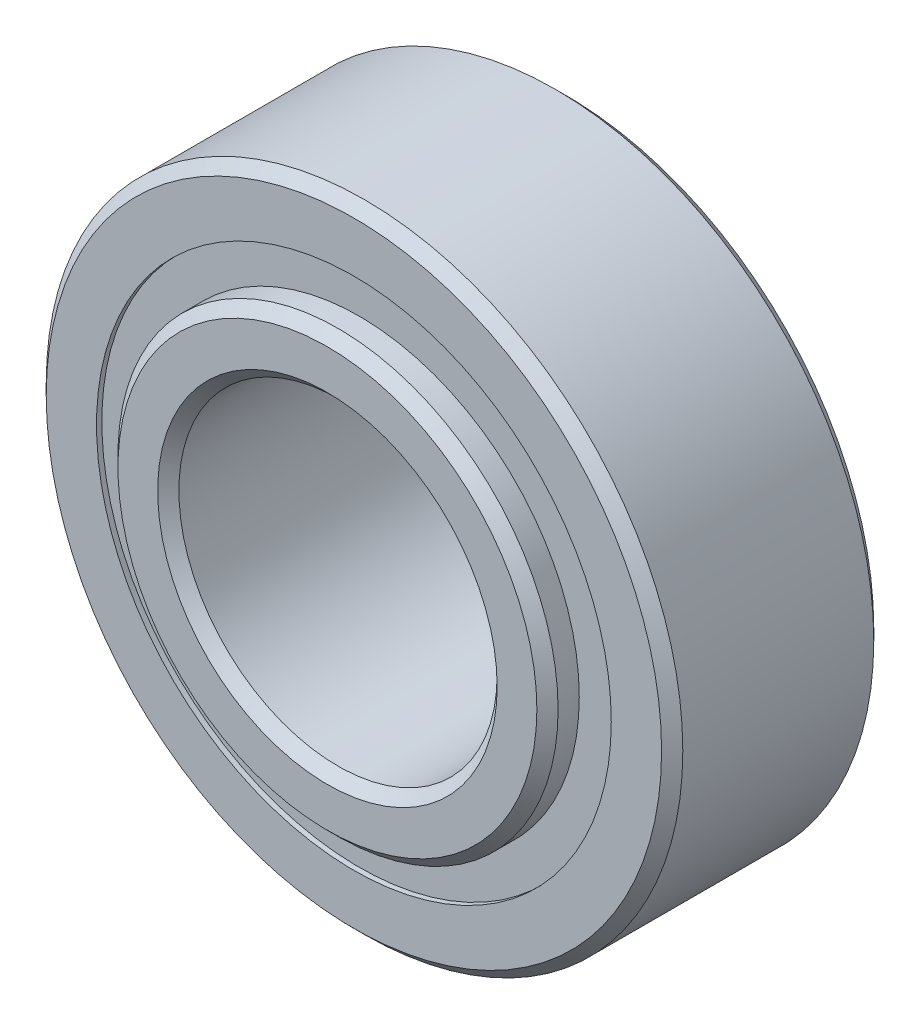
ISO-10303-21;
HEADER;
FILE_DESCRIPTION(('STEP AP214'),'2;1');
FILE_NAME('part.step','',(''),(''),'','','');
FILE_SCHEMA(('AUTOMOTIVE_DESIGN { 1 0 10303 214 1 1 1 1 }'));
ENDSEC;
DATA;
#1=APPLICATION_CONTEXT('core data for automotive mechanical design processes');
#2=APPLICATION_PROTOCOL_DEFINITION('international standard','automotive_design',2000,#1);
#3=PRODUCT_CONTEXT('',#1,'mechanical');
#4=PRODUCT('Part','Part','',(#3));
#5=PRODUCT_RELATED_PRODUCT_CATEGORY('part','',(#4));
#6=PRODUCT_DEFINITION_FORMATION('','',#4);
#7=PRODUCT_DEFINITION_CONTEXT('part definition',#1,'design');
#8=PRODUCT_DEFINITION('design','',#6,#7);
#9=PRODUCT_DEFINITION_SHAPE('','',#8);
#10=(LENGTH_UNIT() NAMED_UNIT(*) SI_UNIT(.MILLI.,.METRE.));
#11=(NAMED_UNIT(*) PLANE_ANGLE_UNIT() SI_UNIT($,.RADIAN.));
#12=(NAMED_UNIT(*) SI_UNIT($,.STERADIAN.) SOLID_ANGLE_UNIT());
#13=UNCERTAINTY_MEASURE_WITH_UNIT(LENGTH_MEASURE(1.E-05),#10,'distance_accuracy_value','');
#14=(GEOMETRIC_REPRESENTATION_CONTEXT(3) GLOBAL_UNCERTAINTY_ASSIGNED_CONTEXT((#13)) GLOBAL_UNIT_ASSIGNED_CONTEXT((#10,
#11,#12)) REPRESENTATION_CONTEXT('',''));
#15=CARTESIAN_POINT('',(0.,0.,0.));
#16=DIRECTION('',(0.,0.,1.));
#17=DIRECTION('',(1.,0.,0.));
#18=AXIS2_PLACEMENT_3D('',#15,#16,#17);
#19=CARTESIAN_POINT('',(0.,3.85099587912088,-1.508125));
#20=DIRECTION('',(0.,0.,1.));
#21=DIRECTION('',(1.,0.,0.));
#22=AXIS2_PLACEMENT_3D('',#19,#20,#21);
#23=PLANE('',#22);
#24=CARTESIAN_POINT('',(0.,0.,-1.508125));
#25=DIRECTION('',(0.,0.,1.));
#26=DIRECTION('',(1.,0.,0.));
#27=AXIS2_PLACEMENT_3D('',#24,#25,#26);
#28=CIRCLE('',#27,3.85099587912088);
#29=CARTESIAN_POINT('',(3.85099587912088,0.,-1.508125));
#30=VERTEX_POINT('',#29);
#31=EDGE_CURVE('E57',#30,#30,#28,.T.);
#32=ORIENTED_EDGE('',*,*,#31,.F.);
#33=EDGE_LOOP('',(#32));
#34=FACE_BOUND('',#33,.T.);
#35=CARTESIAN_POINT('',(0.,0.,-1.508125));
#36=DIRECTION('',(0.,0.,1.));
#37=DIRECTION('',(1.,0.,0.));
#38=AXIS2_PLACEMENT_3D('',#35,#36,#37);
#39=CIRCLE('',#38,3.29275412087912);
#40=CARTESIAN_POINT('',(3.29275412087912,0.,-1.508125));
#41=VERTEX_POINT('',#40);
#42=EDGE_CURVE('E11',#41,#41,#39,.T.);
#43=ORIENTED_EDGE('',*,*,#42,.T.);
#44=EDGE_LOOP('',(#43));
#45=FACE_BOUND('',#44,.T.);
#46=ADVANCED_FACE('F43',(#34,#45),#23,.F.);
#47=CARTESIAN_POINT('',(0.,0.,1.5875));
#48=DIRECTION('',(0.,0.,1.));
#49=DIRECTION('',(1.,0.,0.));
#50=AXIS2_PLACEMENT_3D('',#47,#48,#49);
#51=CYLINDRICAL_SURFACE('',#50,3.29275412087912);
#52=ORIENTED_EDGE('',*,*,#42,.F.);
#53=EDGE_LOOP('',(#52));
#54=FACE_BOUND('',#53,.T.);
#55=CARTESIAN_POINT('',(0.,0.,-0.758760243513405));
#56=DIRECTION('',(0.,0.,1.));
#57=DIRECTION('',(1.,0.,0.));
#58=AXIS2_PLACEMENT_3D('',#55,#56,#57);
#59=CIRCLE('',#58,3.29275412087912);
#60=CARTESIAN_POINT('',(3.29275412087912,0.,-0.758760243513405));
#61=VERTEX_POINT('',#60);
#62=EDGE_CURVE('E49',#61,#61,#59,.T.);
#63=ORIENTED_EDGE('',*,*,#62,.T.);
#64=EDGE_LOOP('',(#63));
#65=FACE_BOUND('',#64,.T.);
#66=ADVANCED_FACE('F66',(#54,#65),#51,.F.);
#67=CARTESIAN_POINT('',(0.,3.85099587912088,-0.758760243513405));
#68=DIRECTION('',(0.,0.,-1.));
#69=DIRECTION('',(-1.,0.,0.));
#70=AXIS2_PLACEMENT_3D('',#67,#68,#69);
#71=PLANE('',#70);
#72=ORIENTED_EDGE('',*,*,#62,.F.);
#73=EDGE_LOOP('',(#72));
#74=FACE_BOUND('',#73,.T.);
#75=CARTESIAN_POINT('',(0.,0.,-0.758760243513405));
#76=DIRECTION('',(0.,0.,1.));
#77=DIRECTION('',(1.,0.,0.));
#78=AXIS2_PLACEMENT_3D('',#75,#76,#77);
#79=CIRCLE('',#78,3.85099587912088);
#80=CARTESIAN_POINT('',(3.85099587912088,0.,-0.758760243513405));
#81=VERTEX_POINT('',#80);
#82=EDGE_CURVE('E53',#81,#81,#79,.T.);
#83=ORIENTED_EDGE('',*,*,#82,.T.);
#84=EDGE_LOOP('',(#83));
#85=FACE_BOUND('',#84,.T.);
#86=ADVANCED_FACE('F70',(#74,#85),#71,.F.);
#87=CARTESIAN_POINT('',(0.,0.,1.5875));
#88=DIRECTION('',(0.,0.,1.));
#89=DIRECTION('',(1.,0.,0.));
#90=AXIS2_PLACEMENT_3D('',#87,#88,#89);
#91=CYLINDRICAL_SURFACE('',#90,3.85099587912088);
#92=ORIENTED_EDGE('',*,*,#82,.F.);
#93=EDGE_LOOP('',(#92));
#94=FACE_BOUND('',#93,.T.);
#95=ORIENTED_EDGE('',*,*,#31,.T.);
#96=EDGE_LOOP('',(#95));
#97=FACE_BOUND('',#96,.T.);
#98=ADVANCED_FACE('F63',(#94,#97),#91,.T.);
#99=CLOSED_SHELL('',(#46,#66,#86,#98));
#100=MANIFOLD_SOLID_BREP('B2',#99);
#101=CARTESIAN_POINT('',(0.,3.85099587912088,1.508125));
#102=DIRECTION('',(0.,0.,-1.));
#103=DIRECTION('',(-1.,0.,0.));
#104=AXIS2_PLACEMENT_3D('',#101,#102,#103);
#105=PLANE('',#104);
#106=CARTESIAN_POINT('',(0.,0.,1.508125));
#107=DIRECTION('',(0.,0.,1.));
#108=DIRECTION('',(1.,0.,0.));
#109=AXIS2_PLACEMENT_3D('',#106,#107,#108);
#110=CIRCLE('',#109,3.29275412087912);
#111=CARTESIAN_POINT('',(3.29275412087912,0.,1.508125));
#112=VERTEX_POINT('',#111);
#113=EDGE_CURVE('E42',#112,#112,#110,.T.);
#114=ORIENTED_EDGE('',*,*,#113,.F.);
#115=EDGE_LOOP('',(#114));
#116=FACE_BOUND('',#115,.T.);
#117=CARTESIAN_POINT('',(0.,0.,1.508125));
#118=DIRECTION('',(0.,0.,1.));
#119=DIRECTION('',(1.,0.,0.));
#120=AXIS2_PLACEMENT_3D('',#117,#118,#119);
#121=CIRCLE('',#120,3.85099587912088);
#122=CARTESIAN_POINT('',(3.85099587912088,0.,1.508125));
#123=VERTEX_POINT('',#122);
#124=EDGE_CURVE('E124',#123,#123,#121,.T.);
#125=ORIENTED_EDGE('',*,*,#124,.T.);
#126=EDGE_LOOP('',(#125));
#127=FACE_BOUND('',#126,.T.);
#128=ADVANCED_FACE('F110',(#116,#127),#105,.F.);
#129=CARTESIAN_POINT('',(0.,0.,1.5875));
#130=DIRECTION('',(0.,0.,1.));
#131=DIRECTION('',(1.,0.,0.));
#132=AXIS2_PLACEMENT_3D('',#129,#130,#131);
#133=CYLINDRICAL_SURFACE('',#132,3.29275412087912);
#134=CARTESIAN_POINT('',(0.,0.,0.758760243513404));
#135=DIRECTION('',(0.,0.,1.));
#136=DIRECTION('',(1.,0.,0.));
#137=AXIS2_PLACEMENT_3D('',#134,#135,#136);
#138=CIRCLE('',#137,3.29275412087912);
#139=CARTESIAN_POINT('',(3.29275412087912,0.,0.758760243513404));
#140=VERTEX_POINT('',#139);
#141=EDGE_CURVE('E116',#140,#140,#138,.T.);
#142=ORIENTED_EDGE('',*,*,#141,.F.);
#143=EDGE_LOOP('',(#142));
#144=FACE_BOUND('',#143,.T.);
#145=ORIENTED_EDGE('',*,*,#113,.T.);
#146=EDGE_LOOP('',(#145));
#147=FACE_BOUND('',#146,.T.);
#148=ADVANCED_FACE('F139',(#144,#147),#133,.F.);
#149=CARTESIAN_POINT('',(0.,3.85099587912088,0.758760243513404));
#150=DIRECTION('',(0.,0.,1.));
#151=DIRECTION('',(1.,0.,0.));
#152=AXIS2_PLACEMENT_3D('',#149,#150,#151);
#153=PLANE('',#152);
#154=CARTESIAN_POINT('',(0.,0.,0.758760243513404));
#155=DIRECTION('',(0.,0.,1.));
#156=DIRECTION('',(1.,0.,0.));
#157=AXIS2_PLACEMENT_3D('',#154,#155,#156);
#158=CIRCLE('',#157,3.85099587912088);
#159=CARTESIAN_POINT('',(3.85099587912088,0.,0.758760243513404));
#160=VERTEX_POINT('',#159);
#161=EDGE_CURVE('E120',#160,#160,#158,.T.);
#162=ORIENTED_EDGE('',*,*,#161,.F.);
#163=EDGE_LOOP('',(#162));
#164=FACE_BOUND('',#163,.T.);
#165=ORIENTED_EDGE('',*,*,#141,.T.);
#166=EDGE_LOOP('',(#165));
#167=FACE_BOUND('',#166,.T.);
#168=ADVANCED_FACE('F134',(#164,#167),#153,.F.);
#169=CARTESIAN_POINT('',(0.,0.,1.5875));
#170=DIRECTION('',(0.,0.,1.));
#171=DIRECTION('',(1.,0.,0.));
#172=AXIS2_PLACEMENT_3D('',#169,#170,#171);
#173=CYLINDRICAL_SURFACE('',#172,3.85099587912088);
#174=ORIENTED_EDGE('',*,*,#124,.F.);
#175=EDGE_LOOP('',(#174));
#176=FACE_BOUND('',#175,.T.);
#177=ORIENTED_EDGE('',*,*,#161,.T.);
#178=EDGE_LOOP('',(#177));
#179=FACE_BOUND('',#178,.T.);
#180=ADVANCED_FACE('F131',(#176,#179),#173,.T.);
#181=CLOSED_SHELL('',(#128,#148,#168,#180));
#182=MANIFOLD_SOLID_BREP('B6',#181);
#183=CARTESIAN_POINT('',(-1.78593749999996,3.09333448914257,0.));
#184=DIRECTION('',(0.,0.,1.));
#185=DIRECTION('',(-0.499999999999989,0.866025403784445,0.));
#186=AXIS2_PLACEMENT_3D('',#183,#184,#185);
#187=SPHERICAL_SURFACE('',#186,0.758760243513405);
#188=CARTESIAN_POINT('',(-1.78593749999996,3.09333448914257,0.758760243513404));
#189=VERTEX_POINT('',#188);
#190=VERTEX_LOOP('',#189);
#191=FACE_BOUND('',#190,.T.);
#192=ADVANCED_FACE('F177',(#191),#187,.T.);
#193=CLOSED_SHELL('',(#192));
#194=MANIFOLD_SOLID_BREP('B37',#193);
#195=CARTESIAN_POINT('',(-3.09333448914252,1.78593750000004,0.));
#196=DIRECTION('',(0.,0.,1.));
#197=DIRECTION('',(-0.866025403784433,0.50000000000001,0.));
#198=AXIS2_PLACEMENT_3D('',#195,#196,#197);
#199=SPHERICAL_SURFACE('',#198,0.758760243513405);
#200=CARTESIAN_POINT('',(-3.09333448914252,1.78593750000004,0.758760243513404));
#201=VERTEX_POINT('',#200);
#202=VERTEX_LOOP('',#201);
#203=FACE_BOUND('',#202,.T.);
#204=ADVANCED_FACE('F197',(#203),#199,.T.);
#205=CLOSED_SHELL('',(#204));
#206=MANIFOLD_SOLID_BREP('B106',#205);
#207=CARTESIAN_POINT('',(-3.571875,0.,0.));
#208=DIRECTION('',(0.,0.,1.));
#209=DIRECTION('',(-1.,0.,0.));
#210=AXIS2_PLACEMENT_3D('',#207,#208,#209);
#211=SPHERICAL_SURFACE('',#210,0.758760243513405);
#212=CARTESIAN_POINT('',(-3.571875,0.,0.758760243513404));
#213=VERTEX_POINT('',#212);
#214=VERTEX_LOOP('',#213);
#215=FACE_BOUND('',#214,.T.);
#216=ADVANCED_FACE('F217',(#215),#211,.T.);
#217=CLOSED_SHELL('',(#216));
#218=MANIFOLD_SOLID_BREP('B173',#217);
#219=CARTESIAN_POINT('',(-3.09333448914256,-1.78593749999997,0.));
#220=DIRECTION('',(0.,0.,1.));
#221=DIRECTION('',(-0.866025403784443,-0.499999999999992,0.));
#222=AXIS2_PLACEMENT_3D('',#219,#220,#221);
#223=SPHERICAL_SURFACE('',#222,0.758760243513405);
#224=CARTESIAN_POINT('',(-3.09333448914256,-1.78593749999997,0.758760243513404));
#225=VERTEX_POINT('',#224);
#226=VERTEX_LOOP('',#225);
#227=FACE_BOUND('',#226,.T.);
#228=ADVANCED_FACE('F237',(#227),#223,.T.);
#229=CLOSED_SHELL('',(#228));
#230=MANIFOLD_SOLID_BREP('B193',#229);
#231=CARTESIAN_POINT('',(-1.78593750000003,-3.09333448914253,0.));
#232=DIRECTION('',(0.,0.,1.));
#233=DIRECTION('',(-0.500000000000007,-0.866025403784435,0.));
#234=AXIS2_PLACEMENT_3D('',#231,#232,#233);
#235=SPHERICAL_SURFACE('',#234,0.758760243513405);
#236=CARTESIAN_POINT('',(-1.78593750000003,-3.09333448914253,0.758760243513404));
#237=VERTEX_POINT('',#236);
#238=VERTEX_LOOP('',#237);
#239=FACE_BOUND('',#238,.T.);
#240=ADVANCED_FACE('F257',(#239),#235,.T.);
#241=CLOSED_SHELL('',(#240));
#242=MANIFOLD_SOLID_BREP('B213',#241);
#243=CARTESIAN_POINT('',(0.,-3.571875,0.));
#244=DIRECTION('',(0.,0.,1.));
#245=DIRECTION('',(0.,-1.,0.));
#246=AXIS2_PLACEMENT_3D('',#243,#244,#245);
#247=SPHERICAL_SURFACE('',#246,0.758760243513405);
#248=CARTESIAN_POINT('',(0.,-3.571875,0.758760243513404));
#249=VERTEX_POINT('',#248);
#250=VERTEX_LOOP('',#249);
#251=FACE_BOUND('',#250,.T.);
#252=ADVANCED_FACE('F277',(#251),#247,.T.);
#253=CLOSED_SHELL('',(#252));
#254=MANIFOLD_SOLID_BREP('B233',#253);
#255=CARTESIAN_POINT('',(1.78593749999998,-3.09333448914255,0.));
#256=DIRECTION('',(0.,0.,1.));
#257=DIRECTION('',(0.499999999999995,-0.866025403784442,0.));
#258=AXIS2_PLACEMENT_3D('',#255,#256,#257);
#259=SPHERICAL_SURFACE('',#258,0.758760243513405);
#260=CARTESIAN_POINT('',(1.78593749999998,-3.09333448914255,0.758760243513404));
#261=VERTEX_POINT('',#260);
#262=VERTEX_LOOP('',#261);
#263=FACE_BOUND('',#262,.T.);
#264=ADVANCED_FACE('F297',(#263),#259,.T.);
#265=CLOSED_SHELL('',(#264));
#266=MANIFOLD_SOLID_BREP('B253',#265);
#267=CARTESIAN_POINT('',(3.09333448914253,-1.78593750000001,0.));
#268=DIRECTION('',(0.,0.,1.));
#269=DIRECTION('',(0.866025403784436,-0.500000000000004,0.));
#270=AXIS2_PLACEMENT_3D('',#267,#268,#269);
#271=SPHERICAL_SURFACE('',#270,0.758760243513405);
#272=CARTESIAN_POINT('',(3.09333448914253,-1.78593750000001,0.758760243513404));
#273=VERTEX_POINT('',#272);
#274=VERTEX_LOOP('',#273);
#275=FACE_BOUND('',#274,.T.);
#276=ADVANCED_FACE('F317',(#275),#271,.T.);
#277=CLOSED_SHELL('',(#276));
#278=MANIFOLD_SOLID_BREP('B273',#277);
#279=CARTESIAN_POINT('',(3.571875,0.,0.));
#280=DIRECTION('',(0.,0.,1.));
#281=DIRECTION('',(1.,0.,0.));
#282=AXIS2_PLACEMENT_3D('',#279,#280,#281);
#283=SPHERICAL_SURFACE('',#282,0.758760243513405);
#284=CARTESIAN_POINT('',(3.571875,0.,0.758760243513404));
#285=VERTEX_POINT('',#284);
#286=VERTEX_LOOP('',#285);
#287=FACE_BOUND('',#286,.T.);
#288=ADVANCED_FACE('F337',(#287),#283,.T.);
#289=CLOSED_SHELL('',(#288));
#290=MANIFOLD_SOLID_BREP('B293',#289);
#291=CARTESIAN_POINT('',(3.09333448914255,1.78593749999999,0.));
#292=DIRECTION('',(0.,0.,1.));
#293=DIRECTION('',(0.86602540378444,0.499999999999998,0.));
#294=AXIS2_PLACEMENT_3D('',#291,#292,#293);
#295=SPHERICAL_SURFACE('',#294,0.758760243513405);
#296=CARTESIAN_POINT('',(3.09333448914255,1.78593749999999,0.758760243513404));
#297=VERTEX_POINT('',#296);
#298=VERTEX_LOOP('',#297);
#299=FACE_BOUND('',#298,.T.);
#300=ADVANCED_FACE('F357',(#299),#295,.T.);
#301=CLOSED_SHELL('',(#300));
#302=MANIFOLD_SOLID_BREP('B313',#301);
#303=CARTESIAN_POINT('',(1.7859375,3.09333448914254,0.));
#304=DIRECTION('',(0.,0.,1.));
#305=DIRECTION('',(0.500000000000001,0.866025403784438,0.));
#306=AXIS2_PLACEMENT_3D('',#303,#304,#305);
#307=SPHERICAL_SURFACE('',#306,0.758760243513405);
#308=CARTESIAN_POINT('',(1.7859375,3.09333448914254,0.758760243513404));
#309=VERTEX_POINT('',#308);
#310=VERTEX_LOOP('',#309);
#311=FACE_BOUND('',#310,.T.);
#312=ADVANCED_FACE('F377',(#311),#307,.T.);
#313=CLOSED_SHELL('',(#312));
#314=MANIFOLD_SOLID_BREP('B333',#313);
#315=CARTESIAN_POINT('',(0.,3.571875,0.));
#316=DIRECTION('',(0.,0.,1.));
#317=DIRECTION('',(0.,1.,0.));
#318=AXIS2_PLACEMENT_3D('',#315,#316,#317);
#319=SPHERICAL_SURFACE('',#318,0.758760243513405);
#320=CARTESIAN_POINT('',(0.,3.571875,0.758760243513404));
#321=VERTEX_POINT('',#320);
#322=VERTEX_LOOP('',#321);
#323=FACE_BOUND('',#322,.T.);
#324=ADVANCED_FACE('F399',(#323),#319,.T.);
#325=CLOSED_SHELL('',(#324));
#326=MANIFOLD_SOLID_BREP('B353',#325);
#327=CARTESIAN_POINT('',(0.,0.,1.82499));
#328=DIRECTION('',(0.,0.,-1.));
#329=DIRECTION('',(-1.,0.,0.));
#330=AXIS2_PLACEMENT_3D('',#327,#328,#329);
#331=CONICAL_SURFACE('',#330,3.29275412087912,0.785398163397446);
#332=CARTESIAN_POINT('',(0.,0.,1.98374));
#333=DIRECTION('',(0.,0.,1.));
#334=DIRECTION('',(1.,0.,0.));
#335=AXIS2_PLACEMENT_3D('',#332,#333,#334);
#336=CIRCLE('',#335,3.13400412087912);
#337=CARTESIAN_POINT('',(3.13400412087912,0.,1.98374));
#338=VERTEX_POINT('',#337);
#339=EDGE_CURVE('E452',#338,#338,#336,.T.);
#340=ORIENTED_EDGE('',*,*,#339,.F.);
#341=EDGE_LOOP('',(#340));
#342=FACE_BOUND('',#341,.T.);
#343=CARTESIAN_POINT('',(0.,0.,1.82499));
#344=DIRECTION('',(0.,0.,1.));
#345=DIRECTION('',(1.,0.,0.));
#346=AXIS2_PLACEMENT_3D('',#343,#344,#345);
#347=CIRCLE('',#346,3.29275412087912);
#348=CARTESIAN_POINT('',(3.29275412087912,0.,1.82499));
#349=VERTEX_POINT('',#348);
#350=EDGE_CURVE('E398',#349,#349,#347,.T.);
#351=ORIENTED_EDGE('',*,*,#350,.T.);
#352=EDGE_LOOP('',(#351));
#353=FACE_BOUND('',#352,.T.);
#354=ADVANCED_FACE('F418',(#342,#353),#331,.T.);
#355=CARTESIAN_POINT('',(0.,0.,1.5875));
#356=DIRECTION('',(0.,0.,1.));
#357=DIRECTION('',(1.,0.,0.));
#358=AXIS2_PLACEMENT_3D('',#355,#356,#357);
#359=CYLINDRICAL_SURFACE('',#358,3.29275412087912);
#360=ORIENTED_EDGE('',*,*,#350,.F.);
#361=EDGE_LOOP('',(#360));
#362=FACE_BOUND('',#361,.T.);
#363=CARTESIAN_POINT('',(0.,0.,0.705555555555554));
#364=DIRECTION('',(0.,0.,1.));
#365=DIRECTION('',(1.,0.,0.));
#366=AXIS2_PLACEMENT_3D('',#363,#364,#365);
#367=CIRCLE('',#366,3.29275412087912);
#368=CARTESIAN_POINT('',(3.29275412087912,0.,0.705555555555554));
#369=VERTEX_POINT('',#368);
#370=EDGE_CURVE('E424',#369,#369,#367,.T.);
#371=ORIENTED_EDGE('',*,*,#370,.T.);
#372=EDGE_LOOP('',(#371));
#373=FACE_BOUND('',#372,.T.);
#374=ADVANCED_FACE('F459',(#362,#373),#359,.T.);
#375=CARTESIAN_POINT('',(0.,0.,0.));
#376=DIRECTION('',(0.,0.,1.));
#377=DIRECTION('',(1.,0.,0.));
#378=AXIS2_PLACEMENT_3D('',#375,#376,#377);
#379=TOROIDAL_SURFACE('',#378,3.57187499999999,0.758760243513403);
#380=ORIENTED_EDGE('',*,*,#370,.F.);
#381=EDGE_LOOP('',(#380));
#382=FACE_BOUND('',#381,.T.);
#383=CARTESIAN_POINT('',(0.,0.,-0.705555555555556));
#384=DIRECTION('',(0.,0.,1.));
#385=DIRECTION('',(1.,0.,0.));
#386=AXIS2_PLACEMENT_3D('',#383,#384,#385);
#387=CIRCLE('',#386,3.29275412087912);
#388=CARTESIAN_POINT('',(3.29275412087912,0.,-0.705555555555556));
#389=VERTEX_POINT('',#388);
#390=EDGE_CURVE('E428',#389,#389,#387,.T.);
#391=ORIENTED_EDGE('',*,*,#390,.T.);
#392=EDGE_LOOP('',(#391));
#393=FACE_BOUND('',#392,.T.);
#394=ADVANCED_FACE('F463',(#382,#393),#379,.F.);
#395=CARTESIAN_POINT('',(0.,0.,1.5875));
#396=DIRECTION('',(0.,0.,1.));
#397=DIRECTION('',(1.,0.,0.));
#398=AXIS2_PLACEMENT_3D('',#395,#396,#397);
#399=CYLINDRICAL_SURFACE('',#398,3.29275412087912);
#400=ORIENTED_EDGE('',*,*,#390,.F.);
#401=EDGE_LOOP('',(#400));
#402=FACE_BOUND('',#401,.T.);
#403=CARTESIAN_POINT('',(0.,0.,-1.82499));
#404=DIRECTION('',(0.,0.,1.));
#405=DIRECTION('',(1.,0.,0.));
#406=AXIS2_PLACEMENT_3D('',#403,#404,#405);
#407=CIRCLE('',#406,3.29275412087912);
#408=CARTESIAN_POINT('',(3.29275412087912,0.,-1.82499));
#409=VERTEX_POINT('',#408);
#410=EDGE_CURVE('E432',#409,#409,#407,.T.);
#411=ORIENTED_EDGE('',*,*,#410,.T.);
#412=EDGE_LOOP('',(#411));
#413=FACE_BOUND('',#412,.T.);
#414=ADVANCED_FACE('F468',(#402,#413),#399,.T.);
#415=CARTESIAN_POINT('',(0.,0.,-1.98374));
#416=DIRECTION('',(0.,0.,1.));
#417=DIRECTION('',(1.,0.,0.));
#418=AXIS2_PLACEMENT_3D('',#415,#416,#417);
#419=CONICAL_SURFACE('',#418,3.13400412087912,0.785398163397447);
#420=ORIENTED_EDGE('',*,*,#410,.F.);
#421=EDGE_LOOP('',(#420));
#422=FACE_BOUND('',#421,.T.);
#423=CARTESIAN_POINT('',(0.,0.,-1.98374));
#424=DIRECTION('',(0.,0.,1.));
#425=DIRECTION('',(1.,0.,0.));
#426=AXIS2_PLACEMENT_3D('',#423,#424,#425);
#427=CIRCLE('',#426,3.13400412087912);
#428=CARTESIAN_POINT('',(3.13400412087912,0.,-1.98374));
#429=VERTEX_POINT('',#428);
#430=EDGE_CURVE('E437',#429,#429,#427,.T.);
#431=ORIENTED_EDGE('',*,*,#430,.T.);
#432=EDGE_LOOP('',(#431));
#433=FACE_BOUND('',#432,.T.);
#434=ADVANCED_FACE('F474',(#422,#433),#419,.T.);
#435=CARTESIAN_POINT('',(0.,3.13400412087912,-1.98374));
#436=DIRECTION('',(0.,0.,1.));
#437=DIRECTION('',(1.,0.,0.));
#438=AXIS2_PLACEMENT_3D('',#435,#436,#437);
#439=PLANE('',#438);
#440=ORIENTED_EDGE('',*,*,#430,.F.);
#441=EDGE_LOOP('',(#440));
#442=FACE_BOUND('',#441,.T.);
#443=CARTESIAN_POINT('',(0.,0.,-1.98374));
#444=DIRECTION('',(0.,0.,1.));
#445=DIRECTION('',(1.,0.,0.));
#446=AXIS2_PLACEMENT_3D('',#443,#444,#445);
#447=CIRCLE('',#446,2.54);
#448=CARTESIAN_POINT('',(2.54,0.,-1.98374));
#449=VERTEX_POINT('',#448);
#450=EDGE_CURVE('E440',#449,#449,#447,.T.);
#451=ORIENTED_EDGE('',*,*,#450,.T.);
#452=EDGE_LOOP('',(#451));
#453=FACE_BOUND('',#452,.T.);
#454=ADVANCED_FACE('F478',(#442,#453),#439,.F.);
#455=CARTESIAN_POINT('',(0.,0.,-1.82499));
#456=DIRECTION('',(0.,0.,-1.));
#457=DIRECTION('',(-1.,0.,0.));
#458=AXIS2_PLACEMENT_3D('',#455,#456,#457);
#459=CONICAL_SURFACE('',#458,2.38125,0.785398163397446);
#460=ORIENTED_EDGE('',*,*,#450,.F.);
#461=EDGE_LOOP('',(#460));
#462=FACE_BOUND('',#461,.T.);
#463=CARTESIAN_POINT('',(0.,0.,-1.82499));
#464=DIRECTION('',(0.,0.,1.));
#465=DIRECTION('',(1.,0.,0.));
#466=AXIS2_PLACEMENT_3D('',#463,#464,#465);
#467=CIRCLE('',#466,2.38125);
#468=CARTESIAN_POINT('',(2.38125,0.,-1.82499));
#469=VERTEX_POINT('',#468);
#470=EDGE_CURVE('E443',#469,#469,#467,.T.);
#471=ORIENTED_EDGE('',*,*,#470,.T.);
#472=EDGE_LOOP('',(#471));
#473=FACE_BOUND('',#472,.T.);
#474=ADVANCED_FACE('F482',(#462,#473),#459,.F.);
#475=CARTESIAN_POINT('',(0.,0.,1.5875));
#476=DIRECTION('',(0.,0.,1.));
#477=DIRECTION('',(1.,0.,0.));
#478=AXIS2_PLACEMENT_3D('',#475,#476,#477);
#479=CYLINDRICAL_SURFACE('',#478,2.38125);
#480=ORIENTED_EDGE('',*,*,#470,.F.);
#481=EDGE_LOOP('',(#480));
#482=FACE_BOUND('',#481,.T.);
#483=CARTESIAN_POINT('',(0.,0.,1.82499));
#484=DIRECTION('',(0.,0.,1.));
#485=DIRECTION('',(1.,0.,0.));
#486=AXIS2_PLACEMENT_3D('',#483,#484,#485);
#487=CIRCLE('',#486,2.38125);
#488=CARTESIAN_POINT('',(2.38125,0.,1.82499));
#489=VERTEX_POINT('',#488);
#490=EDGE_CURVE('E446',#489,#489,#487,.T.);
#491=ORIENTED_EDGE('',*,*,#490,.T.);
#492=EDGE_LOOP('',(#491));
#493=FACE_BOUND('',#492,.T.);
#494=ADVANCED_FACE('F486',(#482,#493),#479,.F.);
#495=CARTESIAN_POINT('',(0.,0.,1.98374));
#496=DIRECTION('',(0.,0.,1.));
#497=DIRECTION('',(1.,0.,0.));
#498=AXIS2_PLACEMENT_3D('',#495,#496,#497);
#499=CONICAL_SURFACE('',#498,2.54,0.785398163397451);
#500=ORIENTED_EDGE('',*,*,#490,.F.);
#501=EDGE_LOOP('',(#500));
#502=FACE_BOUND('',#501,.T.);
#503=CARTESIAN_POINT('',(0.,0.,1.98374));
#504=DIRECTION('',(0.,0.,1.));
#505=DIRECTION('',(1.,0.,0.));
#506=AXIS2_PLACEMENT_3D('',#503,#504,#505);
#507=CIRCLE('',#506,2.54);
#508=CARTESIAN_POINT('',(2.54,0.,1.98374));
#509=VERTEX_POINT('',#508);
#510=EDGE_CURVE('E449',#509,#509,#507,.T.);
#511=ORIENTED_EDGE('',*,*,#510,.T.);
#512=EDGE_LOOP('',(#511));
#513=FACE_BOUND('',#512,.T.);
#514=ADVANCED_FACE('F490',(#502,#513),#499,.F.);
#515=CARTESIAN_POINT('',(0.,2.54,1.98374));
#516=DIRECTION('',(0.,0.,-1.));
#517=DIRECTION('',(-1.,0.,0.));
#518=AXIS2_PLACEMENT_3D('',#515,#516,#517);
#519=PLANE('',#518);
#520=ORIENTED_EDGE('',*,*,#510,.F.);
#521=EDGE_LOOP('',(#520));
#522=FACE_BOUND('',#521,.T.);
#523=ORIENTED_EDGE('',*,*,#339,.T.);
#524=EDGE_LOOP('',(#523));
#525=FACE_BOUND('',#524,.T.);
#526=ADVANCED_FACE('F456',(#522,#525),#519,.F.);
#527=CLOSED_SHELL('',(#354,#374,#394,#414,#434,#454,#474,#494,#514,#526));
#528=MANIFOLD_SOLID_BREP('B373',#527);
#529=CARTESIAN_POINT('',(0.,0.,1.42875));
#530=DIRECTION('',(0.,0.,-1.));
#531=DIRECTION('',(-1.,0.,0.));
#532=AXIS2_PLACEMENT_3D('',#529,#530,#531);
#533=CONICAL_SURFACE('',#532,4.7625,0.785398163397446);
#534=CARTESIAN_POINT('',(0.,0.,1.5875));
#535=DIRECTION('',(0.,0.,1.));
#536=DIRECTION('',(1.,0.,0.));
#537=AXIS2_PLACEMENT_3D('',#534,#535,#536);
#538=CIRCLE('',#537,4.60375);
#539=CARTESIAN_POINT('',(4.60375,0.,1.5875));
#540=VERTEX_POINT('',#539);
#541=EDGE_CURVE('E597',#540,#540,#538,.T.);
#542=ORIENTED_EDGE('',*,*,#541,.F.);
#543=EDGE_LOOP('',(#542));
#544=FACE_BOUND('',#543,.T.);
#545=CARTESIAN_POINT('',(0.,0.,1.42875));
#546=DIRECTION('',(0.,0.,1.));
#547=DIRECTION('',(1.,0.,0.));
#548=AXIS2_PLACEMENT_3D('',#545,#546,#547);
#549=CIRCLE('',#548,4.7625);
#550=CARTESIAN_POINT('',(4.7625,0.,1.42875));
#551=VERTEX_POINT('',#550);
#552=EDGE_CURVE('E417',#551,#551,#549,.T.);
#553=ORIENTED_EDGE('',*,*,#552,.T.);
#554=EDGE_LOOP('',(#553));
#555=FACE_BOUND('',#554,.T.);
#556=ADVANCED_FACE('F569',(#544,#555),#533,.T.);
#557=CARTESIAN_POINT('',(0.,0.,1.5875));
#558=DIRECTION('',(0.,0.,1.));
#559=DIRECTION('',(1.,0.,0.));
#560=AXIS2_PLACEMENT_3D('',#557,#558,#559);
#561=CYLINDRICAL_SURFACE('',#560,4.7625);
#562=ORIENTED_EDGE('',*,*,#552,.F.);
#563=EDGE_LOOP('',(#562));
#564=FACE_BOUND('',#563,.T.);
#565=CARTESIAN_POINT('',(0.,0.,-1.42875));
#566=DIRECTION('',(0.,0.,1.));
#567=DIRECTION('',(1.,0.,0.));
#568=AXIS2_PLACEMENT_3D('',#565,#566,#567);
#569=CIRCLE('',#568,4.7625);
#570=CARTESIAN_POINT('',(4.7625,0.,-1.42875));
#571=VERTEX_POINT('',#570);
#572=EDGE_CURVE('E575',#571,#571,#569,.T.);
#573=ORIENTED_EDGE('',*,*,#572,.T.);
#574=EDGE_LOOP('',(#573));
#575=FACE_BOUND('',#574,.T.);
#576=ADVANCED_FACE('F604',(#564,#575),#561,.T.);
#577=CARTESIAN_POINT('',(0.,0.,-1.5875));
#578=DIRECTION('',(0.,0.,1.));
#579=DIRECTION('',(1.,0.,0.));
#580=AXIS2_PLACEMENT_3D('',#577,#578,#579);
#581=CONICAL_SURFACE('',#580,4.60375,0.785398163397446);
#582=ORIENTED_EDGE('',*,*,#572,.F.);
#583=EDGE_LOOP('',(#582));
#584=FACE_BOUND('',#583,.T.);
#585=CARTESIAN_POINT('',(0.,0.,-1.5875));
#586=DIRECTION('',(0.,0.,1.));
#587=DIRECTION('',(1.,0.,0.));
#588=AXIS2_PLACEMENT_3D('',#585,#586,#587);
#589=CIRCLE('',#588,4.60375);
#590=CARTESIAN_POINT('',(4.60375,0.,-1.5875));
#591=VERTEX_POINT('',#590);
#592=EDGE_CURVE('E579',#591,#591,#589,.T.);
#593=ORIENTED_EDGE('',*,*,#592,.T.);
#594=EDGE_LOOP('',(#593));
#595=FACE_BOUND('',#594,.T.);
#596=ADVANCED_FACE('F608',(#584,#595),#581,.T.);
#597=CARTESIAN_POINT('',(0.,4.60375,-1.5875));
#598=DIRECTION('',(0.,0.,1.));
#599=DIRECTION('',(1.,0.,0.));
#600=AXIS2_PLACEMENT_3D('',#597,#598,#599);
#601=PLANE('',#600);
#602=ORIENTED_EDGE('',*,*,#592,.F.);
#603=EDGE_LOOP('',(#602));
#604=FACE_BOUND('',#603,.T.);
#605=CARTESIAN_POINT('',(0.,0.,-1.5875));
#606=DIRECTION('',(0.,0.,1.));
#607=DIRECTION('',(1.,0.,0.));
#608=AXIS2_PLACEMENT_3D('',#605,#606,#607);
#609=CIRCLE('',#608,3.85099587912088);
#610=CARTESIAN_POINT('',(3.85099587912088,0.,-1.5875));
#611=VERTEX_POINT('',#610);
#612=EDGE_CURVE('E583',#611,#611,#609,.T.);
#613=ORIENTED_EDGE('',*,*,#612,.T.);
#614=EDGE_LOOP('',(#613));
#615=FACE_BOUND('',#614,.T.);
#616=ADVANCED_FACE('F613',(#604,#615),#601,.F.);
#617=CARTESIAN_POINT('',(0.,0.,1.5875));
#618=DIRECTION('',(0.,0.,1.));
#619=DIRECTION('',(1.,0.,0.));
#620=AXIS2_PLACEMENT_3D('',#617,#618,#619);
#621=CYLINDRICAL_SURFACE('',#620,3.85099587912088);
#622=ORIENTED_EDGE('',*,*,#612,.F.);
#623=EDGE_LOOP('',(#622));
#624=FACE_BOUND('',#623,.T.);
#625=CARTESIAN_POINT('',(0.,0.,-0.705555555555556));
#626=DIRECTION('',(0.,0.,1.));
#627=DIRECTION('',(1.,0.,0.));
#628=AXIS2_PLACEMENT_3D('',#625,#626,#627);
#629=CIRCLE('',#628,3.85099587912088);
#630=CARTESIAN_POINT('',(3.85099587912088,0.,-0.705555555555556));
#631=VERTEX_POINT('',#630);
#632=EDGE_CURVE('E588',#631,#631,#629,.T.);
#633=ORIENTED_EDGE('',*,*,#632,.T.);
#634=EDGE_LOOP('',(#633));
#635=FACE_BOUND('',#634,.T.);
#636=ADVANCED_FACE('F619',(#624,#635),#621,.F.);
#637=CARTESIAN_POINT('',(0.,0.,0.));
#638=DIRECTION('',(0.,0.,1.));
#639=DIRECTION('',(1.,0.,0.));
#640=AXIS2_PLACEMENT_3D('',#637,#638,#639);
#641=TOROIDAL_SURFACE('',#640,3.571875,0.758760243513405);
#642=ORIENTED_EDGE('',*,*,#632,.F.);
#643=EDGE_LOOP('',(#642));
#644=FACE_BOUND('',#643,.T.);
#645=CARTESIAN_POINT('',(0.,0.,0.705555555555555));
#646=DIRECTION('',(0.,0.,1.));
#647=DIRECTION('',(1.,0.,0.));
#648=AXIS2_PLACEMENT_3D('',#645,#646,#647);
#649=CIRCLE('',#648,3.85099587912088);
#650=CARTESIAN_POINT('',(3.85099587912088,0.,0.705555555555555));
#651=VERTEX_POINT('',#650);
#652=EDGE_CURVE('E591',#651,#651,#649,.T.);
#653=ORIENTED_EDGE('',*,*,#652,.T.);
#654=EDGE_LOOP('',(#653));
#655=FACE_BOUND('',#654,.T.);
#656=ADVANCED_FACE('F623',(#644,#655),#641,.F.);
#657=CARTESIAN_POINT('',(0.,0.,1.5875));
#658=DIRECTION('',(0.,0.,1.));
#659=DIRECTION('',(1.,0.,0.));
#660=AXIS2_PLACEMENT_3D('',#657,#658,#659);
#661=CYLINDRICAL_SURFACE('',#660,3.85099587912088);
#662=ORIENTED_EDGE('',*,*,#652,.F.);
#663=EDGE_LOOP('',(#662));
#664=FACE_BOUND('',#663,.T.);
#665=CARTESIAN_POINT('',(0.,0.,1.5875));
#666=DIRECTION('',(0.,0.,1.));
#667=DIRECTION('',(1.,0.,0.));
#668=AXIS2_PLACEMENT_3D('',#665,#666,#667);
#669=CIRCLE('',#668,3.85099587912088);
#670=CARTESIAN_POINT('',(3.85099587912088,0.,1.5875));
#671=VERTEX_POINT('',#670);
#672=EDGE_CURVE('E594',#671,#671,#669,.T.);
#673=ORIENTED_EDGE('',*,*,#672,.T.);
#674=EDGE_LOOP('',(#673));
#675=FACE_BOUND('',#674,.T.);
#676=ADVANCED_FACE('F627',(#664,#675),#661,.F.);
#677=CARTESIAN_POINT('',(0.,4.60375,1.5875));
#678=DIRECTION('',(0.,0.,-1.));
#679=DIRECTION('',(-1.,0.,0.));
#680=AXIS2_PLACEMENT_3D('',#677,#678,#679);
#681=PLANE('',#680);
#682=ORIENTED_EDGE('',*,*,#672,.F.);
#683=EDGE_LOOP('',(#682));
#684=FACE_BOUND('',#683,.T.);
#685=ORIENTED_EDGE('',*,*,#541,.T.);
#686=EDGE_LOOP('',(#685));
#687=FACE_BOUND('',#686,.T.);
#688=ADVANCED_FACE('F601',(#684,#687),#681,.F.);
#689=CLOSED_SHELL('',(#556,#576,#596,#616,#636,#656,#676,#688));
#690=MANIFOLD_SOLID_BREP('B393',#689);
#691=ADVANCED_BREP_SHAPE_REPRESENTATION('',(#18,#100,#182,#194,#206,#218,#230,#242,#254,#266,
#278,#290,#302,#314,#326,#528,#690),#14);
#692=SHAPE_DEFINITION_REPRESENTATION(#9,#691);
ENDSEC;
END-ISO-10303-21;
